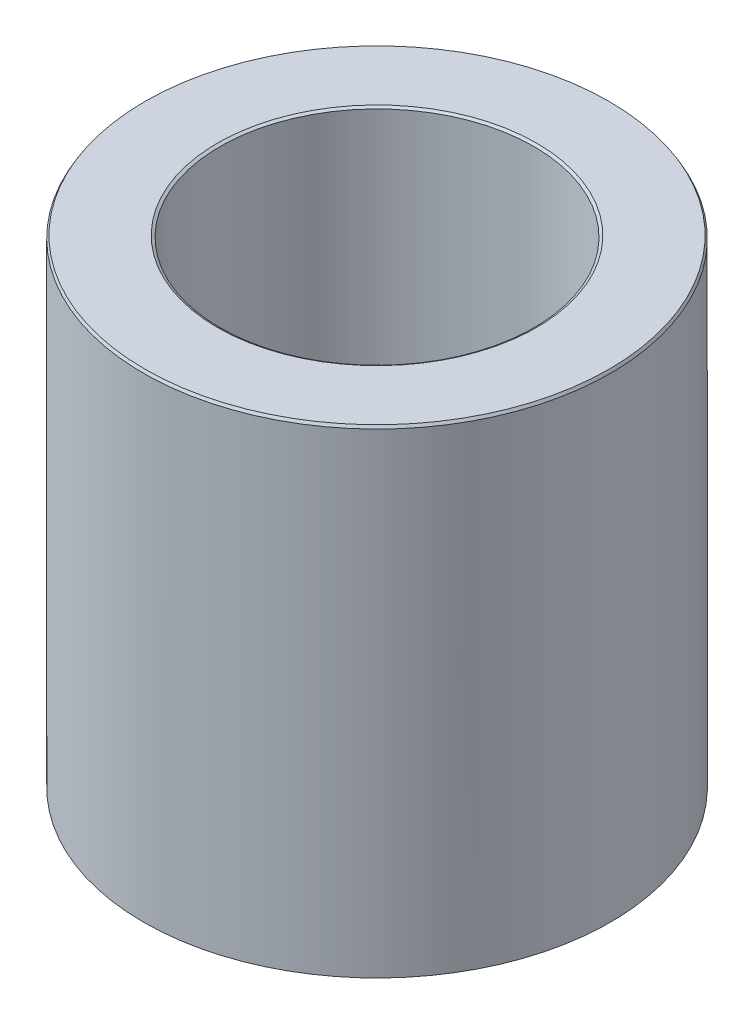
ISO-10303-21;
HEADER;
FILE_DESCRIPTION(('STEP AP214'),'2;1');
FILE_NAME('part.step','',(''),(''),'','','');
FILE_SCHEMA(('AUTOMOTIVE_DESIGN { 1 0 10303 214 1 1 1 1 }'));
ENDSEC;
DATA;
#1=APPLICATION_CONTEXT('core data for automotive mechanical design processes');
#2=APPLICATION_PROTOCOL_DEFINITION('international standard','automotive_design',2000,#1);
#3=PRODUCT_CONTEXT('',#1,'mechanical');
#4=PRODUCT('Part','Part','',(#3));
#5=PRODUCT_RELATED_PRODUCT_CATEGORY('part','',(#4));
#6=PRODUCT_DEFINITION_FORMATION('','',#4);
#7=PRODUCT_DEFINITION_CONTEXT('part definition',#1,'design');
#8=PRODUCT_DEFINITION('design','',#6,#7);
#9=PRODUCT_DEFINITION_SHAPE('','',#8);
#10=(LENGTH_UNIT() NAMED_UNIT(*) SI_UNIT(.MILLI.,.METRE.));
#11=(NAMED_UNIT(*) PLANE_ANGLE_UNIT() SI_UNIT($,.RADIAN.));
#12=(NAMED_UNIT(*) SI_UNIT($,.STERADIAN.) SOLID_ANGLE_UNIT());
#13=UNCERTAINTY_MEASURE_WITH_UNIT(LENGTH_MEASURE(1.E-05),#10,'distance_accuracy_value','');
#14=(GEOMETRIC_REPRESENTATION_CONTEXT(3) GLOBAL_UNCERTAINTY_ASSIGNED_CONTEXT((#13)) GLOBAL_UNIT_ASSIGNED_CONTEXT((#10,
#11,#12)) REPRESENTATION_CONTEXT('',''));
#15=CARTESIAN_POINT('',(0.,0.,0.));
#16=DIRECTION('',(0.,0.,1.));
#17=DIRECTION('',(1.,0.,0.));
#18=AXIS2_PLACEMENT_3D('',#15,#16,#17);
#19=CARTESIAN_POINT('',(0.,61.5996727387543,0.));
#20=DIRECTION('',(0.,-1.,0.));
#21=DIRECTION('',(0.,0.,-1.));
#22=AXIS2_PLACEMENT_3D('',#19,#20,#21);
#23=CYLINDRICAL_SURFACE('',#22,30.);
#24=CARTESIAN_POINT('',(0.,0.202249418565024,0.));
#25=DIRECTION('',(0.,1.,0.));
#26=DIRECTION('',(0.,0.,1.));
#27=AXIS2_PLACEMENT_3D('',#24,#25,#26);
#28=CIRCLE('',#27,30.);
#29=CARTESIAN_POINT('',(0.,0.202249418565018,-30.));
#30=VERTEX_POINT('',#29);
#31=EDGE_CURVE('E10',#30,#30,#28,.T.);
#32=CARTESIAN_POINT('',(0.,61.2564486742938,0.));
#33=DIRECTION('',(0.,1.,0.));
#34=DIRECTION('',(0.,0.,1.));
#35=AXIS2_PLACEMENT_3D('',#32,#33,#34);
#36=CIRCLE('',#35,30.);
#37=CARTESIAN_POINT('',(0.,61.2564486742938,-30.));
#38=VERTEX_POINT('',#37);
#39=EDGE_CURVE('E50',#38,#38,#36,.F.);
#40=CARTESIAN_POINT('',(0.,0.202249418565018,-30.));
#41=CARTESIAN_POINT('',(0.,0.838230660812192,-30.));
#42=CARTESIAN_POINT('',(0.,1.47421190305937,-30.));
#43=CARTESIAN_POINT('',(0.,2.74617438755372,-30.));
#44=CARTESIAN_POINT('',(0.,3.38215562980089,-30.));
#45=CARTESIAN_POINT('',(0.,4.65411811429524,-30.));
#46=CARTESIAN_POINT('',(0.,5.29009935654241,-30.));
#47=CARTESIAN_POINT('',(0.,6.56206184103676,-30.));
#48=CARTESIAN_POINT('',(0.,7.19804308328394,-30.));
#49=CARTESIAN_POINT('',(0.,8.47000556777829,-30.));
#50=CARTESIAN_POINT('',(0.,9.10598681002546,-30.));
#51=CARTESIAN_POINT('',(0.,10.3779492945198,-30.));
#52=CARTESIAN_POINT('',(0.,11.013930536767,-30.));
#53=CARTESIAN_POINT('',(0.,12.2858930212613,-30.));
#54=CARTESIAN_POINT('',(0.,12.9218742635085,-30.));
#55=CARTESIAN_POINT('',(0.,14.1938367480029,-30.));
#56=CARTESIAN_POINT('',(0.,14.82981799025,-30.));
#57=CARTESIAN_POINT('',(0.,16.1017804747444,-30.));
#58=CARTESIAN_POINT('',(0.,16.7377617169916,-30.));
#59=CARTESIAN_POINT('',(0.,18.0097242014859,-30.));
#60=CARTESIAN_POINT('',(0.,18.6457054437331,-30.));
#61=CARTESIAN_POINT('',(0.,19.9176679282274,-30.));
#62=CARTESIAN_POINT('',(0.,20.5536491704746,-30.));
#63=CARTESIAN_POINT('',(0.,21.825611654969,-30.));
#64=CARTESIAN_POINT('',(0.,22.4615928972161,-30.));
#65=CARTESIAN_POINT('',(0.,23.7335553817105,-30.));
#66=CARTESIAN_POINT('',(0.,24.3695366239577,-30.));
#67=CARTESIAN_POINT('',(0.,25.641499108452,-30.));
#68=CARTESIAN_POINT('',(0.,26.2774803506992,-30.));
#69=CARTESIAN_POINT('',(0.,27.5494428351935,-30.));
#70=CARTESIAN_POINT('',(0.,28.1854240774407,-30.));
#71=CARTESIAN_POINT('',(0.,29.4573865619351,-30.));
#72=CARTESIAN_POINT('',(0.,30.0933678041822,-30.));
#73=CARTESIAN_POINT('',(0.,31.3653302886766,-30.));
#74=CARTESIAN_POINT('',(0.,32.0013115309238,-30.));
#75=CARTESIAN_POINT('',(0.,33.2732740154181,-30.));
#76=CARTESIAN_POINT('',(0.,33.9092552576653,-30.));
#77=CARTESIAN_POINT('',(0.,35.1812177421596,-30.));
#78=CARTESIAN_POINT('',(0.,35.8171989844068,-30.));
#79=CARTESIAN_POINT('',(0.,37.0891614689011,-30.));
#80=CARTESIAN_POINT('',(0.,37.7251427111483,-30.));
#81=CARTESIAN_POINT('',(0.,38.9971051956427,-30.));
#82=CARTESIAN_POINT('',(0.,39.6330864378898,-30.));
#83=CARTESIAN_POINT('',(0.,40.9050489223842,-30.));
#84=CARTESIAN_POINT('',(0.,41.5410301646314,-30.));
#85=CARTESIAN_POINT('',(0.,42.8129926491257,-30.));
#86=CARTESIAN_POINT('',(0.,43.4489738913729,-30.));
#87=CARTESIAN_POINT('',(0.,44.7209363758672,-30.));
#88=CARTESIAN_POINT('',(0.,45.3569176181144,-30.));
#89=CARTESIAN_POINT('',(0.,46.6288801026088,-30.));
#90=CARTESIAN_POINT('',(0.,47.2648613448559,-30.));
#91=CARTESIAN_POINT('',(0.,48.5368238293503,-30.));
#92=CARTESIAN_POINT('',(0.,49.1728050715975,-30.));
#93=CARTESIAN_POINT('',(0.,50.4447675560918,-30.));
#94=CARTESIAN_POINT('',(0.,51.080748798339,-30.));
#95=CARTESIAN_POINT('',(0.,52.3527112828333,-30.));
#96=CARTESIAN_POINT('',(0.,52.9886925250805,-30.));
#97=CARTESIAN_POINT('',(0.,54.2606550095749,-30.));
#98=CARTESIAN_POINT('',(0.,54.896636251822,-30.));
#99=CARTESIAN_POINT('',(0.,56.1685987363164,-30.));
#100=CARTESIAN_POINT('',(0.,56.8045799785636,-30.));
#101=CARTESIAN_POINT('',(0.,58.0765424630579,-30.));
#102=CARTESIAN_POINT('',(0.,58.7125237053051,-30.));
#103=CARTESIAN_POINT('',(0.,59.9844861897994,-30.));
#104=CARTESIAN_POINT('',(0.,60.6204674320466,-30.));
#105=CARTESIAN_POINT('',(0.,61.2564486742938,-30.));
#106=B_SPLINE_CURVE_WITH_KNOTS('',3,(#40,#41,#42,#43,#44,#45,#46,#47,#48,#49,#50,#51,#52,#53,
#54,#55,#56,#57,#58,#59,#60,#61,#62,#63,#64,#65,#66,#67,#68,#69,#70,#71,#72,#73,#74,#75,#76,#77,
#78,#79,#80,#81,#82,#83,#84,#85,#86,#87,#88,#89,#90,#91,#92,#93,#94,#95,#96,#97,#98,#99,#100,
#101,#102,#103,#104,#105),.UNSPECIFIED.,.F.,.F.,(4,2,2,2,2,2,2,2,2,2,2,2,2,2,2,2,2,2,2,2,2,2,2,
2,2,2,2,2,2,2,2,2,4),(0.,1.90794372674152,3.81588745348305,5.72383118022457,7.63177490696609,
9.53971863370762,11.4476623604491,13.3556060871907,15.2635498139322,17.1714935406737,
19.0794372674152,20.9873809941568,22.8953247208983,24.8032684476398,26.7112121743813,
28.6191559011229,30.5270996278644,32.4350433546059,34.3429870813474,36.250930808089,
38.1588745348305,40.066818261572,41.9747619883135,43.8827057150551,45.7906494417966,
47.6985931685381,49.6065368952796,51.5144806220211,53.4224243487627,55.3303680755042,
57.2383118022457,59.1462555289872,61.0541992557288),.UNSPECIFIED.);
#107=EDGE_CURVE('BSEAM39',#30,#38,#106,.T.);
#108=ORIENTED_EDGE('',*,*,#31,.T.);
#109=ORIENTED_EDGE('',*,*,#39,.T.);
#110=ORIENTED_EDGE('',*,*,#107,.T.);
#111=ORIENTED_EDGE('',*,*,#107,.F.);
#112=EDGE_LOOP('',(#108,#110,#109,#111));
#113=FACE_BOUND('',#112,.T.);
#114=ADVANCED_FACE('F39',(#113),#23,.T.);
#115=CARTESIAN_POINT('',(0.,61.5996727387543,0.));
#116=DIRECTION('',(0.,1.,0.));
#117=DIRECTION('',(0.,0.,1.));
#118=AXIS2_PLACEMENT_3D('',#115,#116,#117);
#119=PLANE('',#118);
#120=CARTESIAN_POINT('',(0.,61.5996727387543,0.));
#121=DIRECTION('',(0.,1.,0.));
#122=DIRECTION('',(0.,0.,1.));
#123=AXIS2_PLACEMENT_3D('',#120,#121,#122);
#124=CIRCLE('',#123,20.5056692388767);
#125=CARTESIAN_POINT('',(0.,61.5996727387543,20.5056692388767));
#126=VERTEX_POINT('',#125);
#127=EDGE_CURVE('E58',#126,#126,#124,.F.);
#128=ORIENTED_EDGE('',*,*,#127,.T.);
#129=EDGE_LOOP('',(#128));
#130=FACE_BOUND('',#129,.T.);
#131=CARTESIAN_POINT('',(0.,61.5996727387543,0.));
#132=DIRECTION('',(0.,1.,0.));
#133=DIRECTION('',(0.,0.,1.));
#134=AXIS2_PLACEMENT_3D('',#131,#132,#133);
#135=CIRCLE('',#134,29.7977505814351);
#136=CARTESIAN_POINT('',(0.,61.5996727387543,29.7977505814351));
#137=VERTEX_POINT('',#136);
#138=EDGE_CURVE('E61',#137,#137,#135,.T.);
#139=ORIENTED_EDGE('',*,*,#138,.T.);
#140=EDGE_LOOP('',(#139));
#141=FACE_BOUND('',#140,.T.);
#142=ADVANCED_FACE('F88',(#130,#141),#119,.T.);
#143=CARTESIAN_POINT('',(0.,0.,0.));
#144=DIRECTION('',(0.,1.,0.));
#145=DIRECTION('',(0.,0.,1.));
#146=AXIS2_PLACEMENT_3D('',#143,#144,#145);
#147=PLANE('',#146);
#148=CARTESIAN_POINT('',(0.,0.,0.));
#149=DIRECTION('',(0.,1.,0.));
#150=DIRECTION('',(0.,0.,1.));
#151=AXIS2_PLACEMENT_3D('',#148,#149,#150);
#152=CIRCLE('',#151,20.364694592981);
#153=CARTESIAN_POINT('',(0.,0.,20.364694592981));
#154=VERTEX_POINT('',#153);
#155=EDGE_CURVE('E51',#154,#154,#152,.T.);
#156=ORIENTED_EDGE('',*,*,#155,.T.);
#157=EDGE_LOOP('',(#156));
#158=FACE_BOUND('',#157,.T.);
#159=CARTESIAN_POINT('',(0.,0.,0.));
#160=DIRECTION('',(0.,1.,0.));
#161=DIRECTION('',(0.,0.,1.));
#162=AXIS2_PLACEMENT_3D('',#159,#160,#161);
#163=CIRCLE('',#162,29.6567759355393);
#164=CARTESIAN_POINT('',(0.,0.,29.6567759355393));
#165=VERTEX_POINT('',#164);
#166=EDGE_CURVE('E54',#165,#165,#163,.F.);
#167=ORIENTED_EDGE('',*,*,#166,.T.);
#168=EDGE_LOOP('',(#167));
#169=FACE_BOUND('',#168,.T.);
#170=ADVANCED_FACE('F83',(#158,#169),#147,.F.);
#171=CARTESIAN_POINT('',(0.,61.5996727387543,0.));
#172=DIRECTION('',(0.,-1.,0.));
#173=DIRECTION('',(0.,0.,-1.));
#174=AXIS2_PLACEMENT_3D('',#171,#172,#173);
#175=CYLINDRICAL_SURFACE('',#174,20.162445174416);
#176=CARTESIAN_POINT('',(0.,61.3974233201893,0.));
#177=DIRECTION('',(0.,1.,0.));
#178=DIRECTION('',(0.,0.,1.));
#179=AXIS2_PLACEMENT_3D('',#176,#177,#178);
#180=CIRCLE('',#179,20.162445174416);
#181=CARTESIAN_POINT('',(0.,61.3974233201892,-20.162445174416));
#182=VERTEX_POINT('',#181);
#183=EDGE_CURVE('E67',#182,#182,#180,.T.);
#184=CARTESIAN_POINT('',(0.,0.343224064460648,0.));
#185=DIRECTION('',(0.,1.,0.));
#186=DIRECTION('',(0.,0.,1.));
#187=AXIS2_PLACEMENT_3D('',#184,#185,#186);
#188=CIRCLE('',#187,20.162445174416);
#189=CARTESIAN_POINT('',(0.,0.343224064460648,-20.162445174416));
#190=VERTEX_POINT('',#189);
#191=EDGE_CURVE('E69',#190,#190,#188,.F.);
#192=CARTESIAN_POINT('',(0.,61.3974233201892,-20.162445174416));
#193=CARTESIAN_POINT('',(0.,60.7614420779421,-20.162445174416));
#194=CARTESIAN_POINT('',(0.,60.1254608356949,-20.162445174416));
#195=CARTESIAN_POINT('',(0.,58.8534983512006,-20.162445174416));
#196=CARTESIAN_POINT('',(0.,58.2175171089534,-20.162445174416));
#197=CARTESIAN_POINT('',(0.,56.945554624459,-20.162445174416));
#198=CARTESIAN_POINT('',(0.,56.3095733822119,-20.162445174416));
#199=CARTESIAN_POINT('',(0.,55.0376108977175,-20.162445174416));
#200=CARTESIAN_POINT('',(0.,54.4016296554704,-20.162445174416));
#201=CARTESIAN_POINT('',(0.,53.129667170976,-20.162445174416));
#202=CARTESIAN_POINT('',(0.,52.4936859287288,-20.162445174416));
#203=CARTESIAN_POINT('',(0.,51.2217234442345,-20.162445174416));
#204=CARTESIAN_POINT('',(0.,50.5857422019873,-20.162445174416));
#205=CARTESIAN_POINT('',(0.,49.313779717493,-20.162445174416));
#206=CARTESIAN_POINT('',(0.,48.6777984752458,-20.162445174416));
#207=CARTESIAN_POINT('',(0.,47.4058359907514,-20.162445174416));
#208=CARTESIAN_POINT('',(0.,46.7698547485043,-20.162445174416));
#209=CARTESIAN_POINT('',(0.,45.4978922640099,-20.162445174416));
#210=CARTESIAN_POINT('',(0.,44.8619110217628,-20.162445174416));
#211=CARTESIAN_POINT('',(0.,43.5899485372684,-20.162445174416));
#212=CARTESIAN_POINT('',(0.,42.9539672950212,-20.162445174416));
#213=CARTESIAN_POINT('',(0.,41.6820048105269,-20.162445174416));
#214=CARTESIAN_POINT('',(0.,41.0460235682797,-20.162445174416));
#215=CARTESIAN_POINT('',(0.,39.7740610837854,-20.162445174416));
#216=CARTESIAN_POINT('',(0.,39.1380798415382,-20.162445174416));
#217=CARTESIAN_POINT('',(0.,37.8661173570439,-20.162445174416));
#218=CARTESIAN_POINT('',(0.,37.2301361147967,-20.162445174416));
#219=CARTESIAN_POINT('',(0.,35.9581736303023,-20.162445174416));
#220=CARTESIAN_POINT('',(0.,35.3221923880552,-20.162445174416));
#221=CARTESIAN_POINT('',(0.,34.0502299035608,-20.162445174416));
#222=CARTESIAN_POINT('',(0.,33.4142486613136,-20.162445174416));
#223=CARTESIAN_POINT('',(0.,32.1422861768193,-20.162445174416));
#224=CARTESIAN_POINT('',(0.,31.5063049345721,-20.162445174416));
#225=CARTESIAN_POINT('',(0.,30.2343424500778,-20.162445174416));
#226=CARTESIAN_POINT('',(0.,29.5983612078306,-20.162445174416));
#227=CARTESIAN_POINT('',(0.,28.3263987233363,-20.162445174416));
#228=CARTESIAN_POINT('',(0.,27.6904174810891,-20.162445174416));
#229=CARTESIAN_POINT('',(0.,26.4184549965947,-20.162445174416));
#230=CARTESIAN_POINT('',(0.,25.7824737543476,-20.162445174416));
#231=CARTESIAN_POINT('',(0.,24.5105112698532,-20.162445174416));
#232=CARTESIAN_POINT('',(0.,23.874530027606,-20.162445174416));
#233=CARTESIAN_POINT('',(0.,22.6025675431117,-20.162445174416));
#234=CARTESIAN_POINT('',(0.,21.9665863008645,-20.162445174416));
#235=CARTESIAN_POINT('',(0.,20.6946238163702,-20.162445174416));
#236=CARTESIAN_POINT('',(0.,20.058642574123,-20.162445174416));
#237=CARTESIAN_POINT('',(0.,18.7866800896287,-20.162445174416));
#238=CARTESIAN_POINT('',(0.,18.1506988473815,-20.162445174416));
#239=CARTESIAN_POINT('',(0.,16.8787363628871,-20.162445174416));
#240=CARTESIAN_POINT('',(0.,16.24275512064,-20.162445174416));
#241=CARTESIAN_POINT('',(0.,14.9707926361456,-20.162445174416));
#242=CARTESIAN_POINT('',(0.,14.3348113938985,-20.162445174416));
#243=CARTESIAN_POINT('',(0.,13.0628489094041,-20.162445174416));
#244=CARTESIAN_POINT('',(0.,12.4268676671569,-20.162445174416));
#245=CARTESIAN_POINT('',(0.,11.1549051826626,-20.162445174416));
#246=CARTESIAN_POINT('',(0.,10.5189239404154,-20.162445174416));
#247=CARTESIAN_POINT('',(0.,9.24696145592107,-20.162445174416));
#248=CARTESIAN_POINT('',(0.,8.6109802136739,-20.162445174416));
#249=CARTESIAN_POINT('',(0.,7.33901772917955,-20.162445174416));
#250=CARTESIAN_POINT('',(0.,6.70303648693238,-20.162445174416));
#251=CARTESIAN_POINT('',(0.,5.43107400243803,-20.162445174416));
#252=CARTESIAN_POINT('',(0.,4.79509276019086,-20.162445174416));
#253=CARTESIAN_POINT('',(0.,3.52313027569651,-20.162445174416));
#254=CARTESIAN_POINT('',(0.,2.88714903344934,-20.162445174416));
#255=CARTESIAN_POINT('',(0.,1.61518654895499,-20.162445174416));
#256=CARTESIAN_POINT('',(0.,0.97920530670782,-20.162445174416));
#257=CARTESIAN_POINT('',(0.,0.343224064460648,-20.162445174416));
#258=B_SPLINE_CURVE_WITH_KNOTS('',3,(#192,#193,#194,#195,#196,#197,#198,#199,#200,#201,#202,
#203,#204,#205,#206,#207,#208,#209,#210,#211,#212,#213,#214,#215,#216,#217,#218,#219,#220,#221,
#222,#223,#224,#225,#226,#227,#228,#229,#230,#231,#232,#233,#234,#235,#236,#237,#238,#239,#240,
#241,#242,#243,#244,#245,#246,#247,#248,#249,#250,#251,#252,#253,#254,#255,#256,#257),
.UNSPECIFIED.,.F.,.F.,(4,2,2,2,2,2,2,2,2,2,2,2,2,2,2,2,2,2,2,2,2,2,2,2,2,2,2,2,2,2,2,2,4),(0.,
1.90794372674152,3.81588745348303,5.72383118022455,7.63177490696607,9.53971863370759,
11.4476623604491,13.3556060871906,15.2635498139321,17.1714935406737,19.0794372674152,
20.9873809941567,22.8953247208982,24.8032684476397,26.7112121743813,28.6191559011228,
30.5270996278643,32.4350433546058,34.3429870813473,36.2509308080889,38.1588745348304,
40.0668182615719,41.9747619883134,43.8827057150549,45.7906494417964,47.698593168538,
49.6065368952795,51.514480622021,53.4224243487625,55.330368075504,57.2383118022456,
59.1462555289871,61.0541992557286),.UNSPECIFIED.);
#259=EDGE_CURVE('BSEAM71',#182,#190,#258,.T.);
#260=ORIENTED_EDGE('',*,*,#183,.T.);
#261=ORIENTED_EDGE('',*,*,#191,.T.);
#262=ORIENTED_EDGE('',*,*,#259,.T.);
#263=ORIENTED_EDGE('',*,*,#259,.F.);
#264=EDGE_LOOP('',(#260,#262,#261,#263));
#265=FACE_BOUND('',#264,.T.);
#266=ADVANCED_FACE('F71',(#265),#175,.F.);
#267=CARTESIAN_POINT('',(0.,61.3974233201893,0.));
#268=DIRECTION('',(0.,1.,0.));
#269=DIRECTION('',(0.,0.,1.));
#270=AXIS2_PLACEMENT_3D('',#267,#268,#269);
#271=CONICAL_SURFACE('',#270,20.162445174416,1.03830870623828);
#272=ORIENTED_EDGE('',*,*,#127,.F.);
#273=EDGE_LOOP('',(#272));
#274=FACE_BOUND('',#273,.T.);
#275=ORIENTED_EDGE('',*,*,#183,.F.);
#276=EDGE_LOOP('',(#275));
#277=FACE_BOUND('',#276,.T.);
#278=ADVANCED_FACE('F77',(#274,#277),#271,.F.);
#279=CARTESIAN_POINT('',(0.,0.,0.));
#280=DIRECTION('',(0.,-1.,0.));
#281=DIRECTION('',(0.,0.,-1.));
#282=AXIS2_PLACEMENT_3D('',#279,#280,#281);
#283=CONICAL_SURFACE('',#282,20.364694592981,0.532487620556594);
#284=ORIENTED_EDGE('',*,*,#191,.F.);
#285=EDGE_LOOP('',(#284));
#286=FACE_BOUND('',#285,.T.);
#287=ORIENTED_EDGE('',*,*,#155,.F.);
#288=EDGE_LOOP('',(#287));
#289=FACE_BOUND('',#288,.T.);
#290=ADVANCED_FACE('F73',(#286,#289),#283,.F.);
#291=CARTESIAN_POINT('',(0.,0.202249418565024,0.));
#292=DIRECTION('',(0.,1.,0.));
#293=DIRECTION('',(0.,0.,1.));
#294=AXIS2_PLACEMENT_3D('',#291,#292,#293);
#295=CONICAL_SURFACE('',#294,30.,1.0383087062383);
#296=ORIENTED_EDGE('',*,*,#166,.F.);
#297=EDGE_LOOP('',(#296));
#298=FACE_BOUND('',#297,.T.);
#299=ORIENTED_EDGE('',*,*,#31,.F.);
#300=EDGE_LOOP('',(#299));
#301=FACE_BOUND('',#300,.T.);
#302=ADVANCED_FACE('F76',(#298,#301),#295,.T.);
#303=CARTESIAN_POINT('',(0.,61.5996727387543,0.));
#304=DIRECTION('',(0.,-1.,0.));
#305=DIRECTION('',(0.,0.,-1.));
#306=AXIS2_PLACEMENT_3D('',#303,#304,#305);
#307=CONICAL_SURFACE('',#306,29.7977505814351,0.532487620556597);
#308=ORIENTED_EDGE('',*,*,#39,.F.);
#309=EDGE_LOOP('',(#308));
#310=FACE_BOUND('',#309,.T.);
#311=ORIENTED_EDGE('',*,*,#138,.F.);
#312=EDGE_LOOP('',(#311));
#313=FACE_BOUND('',#312,.T.);
#314=ADVANCED_FACE('F45',(#310,#313),#307,.T.);
#315=CLOSED_SHELL('',(#114,#142,#170,#266,#278,#290,#302,#314));
#316=MANIFOLD_SOLID_BREP('B2',#315);
#317=ADVANCED_BREP_SHAPE_REPRESENTATION('',(#18,#316),#14);
#318=SHAPE_DEFINITION_REPRESENTATION(#9,#317);
ENDSEC;
END-ISO-10303-21;
